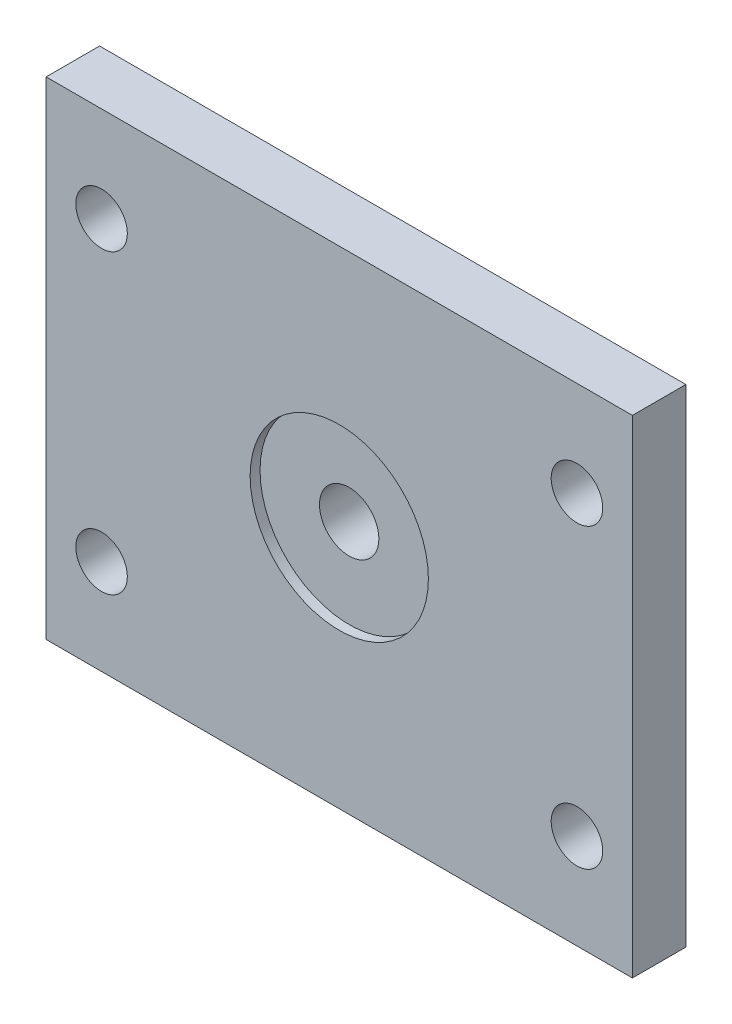
ISO-10303-21;
HEADER;
FILE_DESCRIPTION(('STEP AP214'),'2;1');
FILE_NAME('part.step','',(''),(''),'','','');
FILE_SCHEMA(('AUTOMOTIVE_DESIGN { 1 0 10303 214 1 1 1 1 }'));
ENDSEC;
DATA;
#1=APPLICATION_CONTEXT('core data for automotive mechanical design processes');
#2=APPLICATION_PROTOCOL_DEFINITION('international standard','automotive_design',2000,#1);
#3=PRODUCT_CONTEXT('',#1,'mechanical');
#4=PRODUCT('Part','Part','',(#3));
#5=PRODUCT_RELATED_PRODUCT_CATEGORY('part','',(#4));
#6=PRODUCT_DEFINITION_FORMATION('','',#4);
#7=PRODUCT_DEFINITION_CONTEXT('part definition',#1,'design');
#8=PRODUCT_DEFINITION('design','',#6,#7);
#9=PRODUCT_DEFINITION_SHAPE('','',#8);
#10=(LENGTH_UNIT() NAMED_UNIT(*) SI_UNIT(.MILLI.,.METRE.));
#11=(NAMED_UNIT(*) PLANE_ANGLE_UNIT() SI_UNIT($,.RADIAN.));
#12=(NAMED_UNIT(*) SI_UNIT($,.STERADIAN.) SOLID_ANGLE_UNIT());
#13=UNCERTAINTY_MEASURE_WITH_UNIT(LENGTH_MEASURE(1.E-05),#10,'distance_accuracy_value','');
#14=(GEOMETRIC_REPRESENTATION_CONTEXT(3) GLOBAL_UNCERTAINTY_ASSIGNED_CONTEXT((#13)) GLOBAL_UNIT_ASSIGNED_CONTEXT((#10,
#11,#12)) REPRESENTATION_CONTEXT('',''));
#15=CARTESIAN_POINT('',(0.,0.,0.));
#16=DIRECTION('',(0.,0.,1.));
#17=DIRECTION('',(1.,0.,0.));
#18=AXIS2_PLACEMENT_3D('',#15,#16,#17);
#19=CARTESIAN_POINT('',(-148.,123.,27.));
#20=DIRECTION('',(0.,0.,1.));
#21=DIRECTION('',(1.,0.,0.));
#22=AXIS2_PLACEMENT_3D('',#19,#20,#21);
#23=PLANE('',#22);
#24=CARTESIAN_POINT('',(-120.,-75.,27.));
#25=DIRECTION('',(0.,0.,1.));
#26=DIRECTION('',(1.,0.,0.));
#27=AXIS2_PLACEMENT_3D('',#24,#25,#26);
#28=CIRCLE('',#27,13.);
#29=CARTESIAN_POINT('',(-107.,-75.,27.));
#30=VERTEX_POINT('',#29);
#31=EDGE_CURVE('E129',#30,#30,#28,.T.);
#32=ORIENTED_EDGE('',*,*,#31,.F.);
#33=EDGE_LOOP('',(#32));
#34=FACE_BOUND('',#33,.T.);
#35=CARTESIAN_POINT('',(120.,75.,27.));
#36=DIRECTION('',(0.,0.,1.));
#37=DIRECTION('',(1.,0.,0.));
#38=AXIS2_PLACEMENT_3D('',#35,#36,#37);
#39=CIRCLE('',#38,13.);
#40=CARTESIAN_POINT('',(133.,75.,27.));
#41=VERTEX_POINT('',#40);
#42=EDGE_CURVE('E117',#41,#41,#39,.T.);
#43=ORIENTED_EDGE('',*,*,#42,.F.);
#44=EDGE_LOOP('',(#43));
#45=FACE_BOUND('',#44,.T.);
#46=DIRECTION('',(0.,-1.,0.));
#47=VECTOR('',#46,1.);
#48=CARTESIAN_POINT('',(-148.,-123.,27.));
#49=LINE('',#48,#47);
#50=CARTESIAN_POINT('',(-148.,123.,27.));
#51=VERTEX_POINT('',#50);
#52=CARTESIAN_POINT('',(-148.,-123.,27.));
#53=VERTEX_POINT('',#52);
#54=EDGE_CURVE('E87',#51,#53,#49,.T.);
#55=ORIENTED_EDGE('',*,*,#54,.T.);
#56=DIRECTION('',(1.,0.,0.));
#57=VECTOR('',#56,1.);
#58=CARTESIAN_POINT('',(148.,-123.,27.));
#59=LINE('',#58,#57);
#60=CARTESIAN_POINT('',(148.,-123.,27.));
#61=VERTEX_POINT('',#60);
#62=EDGE_CURVE('E82',#53,#61,#59,.T.);
#63=ORIENTED_EDGE('',*,*,#62,.T.);
#64=DIRECTION('',(0.,1.,0.));
#65=VECTOR('',#64,1.);
#66=CARTESIAN_POINT('',(148.,-123.,27.));
#67=LINE('',#66,#65);
#68=CARTESIAN_POINT('',(148.,123.,27.));
#69=VERTEX_POINT('',#68);
#70=EDGE_CURVE('E85',#61,#69,#67,.T.);
#71=ORIENTED_EDGE('',*,*,#70,.T.);
#72=DIRECTION('',(-1.,0.,0.));
#73=VECTOR('',#72,1.);
#74=CARTESIAN_POINT('',(148.,123.,27.));
#75=LINE('',#74,#73);
#76=EDGE_CURVE('E52',#69,#51,#75,.T.);
#77=ORIENTED_EDGE('',*,*,#76,.T.);
#78=EDGE_LOOP('',(#55,#63,#71,#77));
#79=FACE_BOUND('',#78,.T.);
#80=CARTESIAN_POINT('',(-120.,75.,27.));
#81=DIRECTION('',(0.,0.,1.));
#82=DIRECTION('',(1.,0.,0.));
#83=AXIS2_PLACEMENT_3D('',#80,#81,#82);
#84=CIRCLE('',#83,13.);
#85=CARTESIAN_POINT('',(-107.,75.,27.));
#86=VERTEX_POINT('',#85);
#87=EDGE_CURVE('E102',#86,#86,#84,.T.);
#88=ORIENTED_EDGE('',*,*,#87,.F.);
#89=EDGE_LOOP('',(#88));
#90=FACE_BOUND('',#89,.T.);
#91=CARTESIAN_POINT('',(120.,-75.,27.));
#92=DIRECTION('',(0.,0.,1.));
#93=DIRECTION('',(1.,0.,0.));
#94=AXIS2_PLACEMENT_3D('',#91,#92,#93);
#95=CIRCLE('',#94,13.);
#96=CARTESIAN_POINT('',(133.,-75.,27.));
#97=VERTEX_POINT('',#96);
#98=EDGE_CURVE('E123',#97,#97,#95,.T.);
#99=ORIENTED_EDGE('',*,*,#98,.F.);
#100=EDGE_LOOP('',(#99));
#101=FACE_BOUND('',#100,.T.);
#102=CARTESIAN_POINT('',(0.,0.,27.));
#103=DIRECTION('',(0.,0.,-1.));
#104=DIRECTION('',(-1.,0.,0.));
#105=AXIS2_PLACEMENT_3D('',#102,#103,#104);
#106=CIRCLE('',#105,45.);
#107=CARTESIAN_POINT('',(-45.,0.,27.));
#108=VERTEX_POINT('',#107);
#109=EDGE_CURVE('E138',#108,#108,#106,.T.);
#110=ORIENTED_EDGE('',*,*,#109,.T.);
#111=EDGE_LOOP('',(#110));
#112=FACE_BOUND('',#111,.T.);
#113=ADVANCED_FACE('F35',(#34,#45,#79,#90,#101,#112),#23,.T.);
#114=CARTESIAN_POINT('',(-148.,123.,0.));
#115=DIRECTION('',(0.,0.,1.));
#116=DIRECTION('',(1.,0.,0.));
#117=AXIS2_PLACEMENT_3D('',#114,#115,#116);
#118=PLANE('',#117);
#119=CARTESIAN_POINT('',(0.,0.,0.));
#120=DIRECTION('',(0.,0.,1.));
#121=DIRECTION('',(1.,0.,0.));
#122=AXIS2_PLACEMENT_3D('',#119,#120,#121);
#123=CIRCLE('',#122,15.);
#124=CARTESIAN_POINT('',(15.,0.,0.));
#125=VERTEX_POINT('',#124);
#126=EDGE_CURVE('E141',#125,#125,#123,.T.);
#127=ORIENTED_EDGE('',*,*,#126,.T.);
#128=EDGE_LOOP('',(#127));
#129=FACE_BOUND('',#128,.T.);
#130=CARTESIAN_POINT('',(120.,-75.,0.));
#131=DIRECTION('',(0.,0.,1.));
#132=DIRECTION('',(1.,0.,0.));
#133=AXIS2_PLACEMENT_3D('',#130,#131,#132);
#134=CIRCLE('',#133,13.);
#135=CARTESIAN_POINT('',(133.,-75.,0.));
#136=VERTEX_POINT('',#135);
#137=EDGE_CURVE('E126',#136,#136,#134,.T.);
#138=ORIENTED_EDGE('',*,*,#137,.T.);
#139=EDGE_LOOP('',(#138));
#140=FACE_BOUND('',#139,.T.);
#141=CARTESIAN_POINT('',(-120.,75.,0.));
#142=DIRECTION('',(0.,0.,1.));
#143=DIRECTION('',(1.,0.,0.));
#144=AXIS2_PLACEMENT_3D('',#141,#142,#143);
#145=CIRCLE('',#144,13.);
#146=CARTESIAN_POINT('',(-107.,75.,0.));
#147=VERTEX_POINT('',#146);
#148=EDGE_CURVE('E114',#147,#147,#145,.T.);
#149=ORIENTED_EDGE('',*,*,#148,.T.);
#150=EDGE_LOOP('',(#149));
#151=FACE_BOUND('',#150,.T.);
#152=DIRECTION('',(0.,-1.,0.));
#153=VECTOR('',#152,1.);
#154=CARTESIAN_POINT('',(-148.,-123.,0.));
#155=LINE('',#154,#153);
#156=CARTESIAN_POINT('',(-148.,123.,0.));
#157=VERTEX_POINT('',#156);
#158=CARTESIAN_POINT('',(-148.,-123.,0.));
#159=VERTEX_POINT('',#158);
#160=EDGE_CURVE('E99',#157,#159,#155,.T.);
#161=ORIENTED_EDGE('',*,*,#160,.F.);
#162=DIRECTION('',(-1.,0.,0.));
#163=VECTOR('',#162,1.);
#164=CARTESIAN_POINT('',(148.,123.,0.));
#165=LINE('',#164,#163);
#166=CARTESIAN_POINT('',(148.,123.,0.));
#167=VERTEX_POINT('',#166);
#168=EDGE_CURVE('E75',#167,#157,#165,.T.);
#169=ORIENTED_EDGE('',*,*,#168,.F.);
#170=DIRECTION('',(0.,1.,0.));
#171=VECTOR('',#170,1.);
#172=CARTESIAN_POINT('',(148.,-123.,0.));
#173=LINE('',#172,#171);
#174=CARTESIAN_POINT('',(148.,-123.,0.));
#175=VERTEX_POINT('',#174);
#176=EDGE_CURVE('E69',#175,#167,#173,.T.);
#177=ORIENTED_EDGE('',*,*,#176,.F.);
#178=DIRECTION('',(1.,0.,0.));
#179=VECTOR('',#178,1.);
#180=CARTESIAN_POINT('',(148.,-123.,0.));
#181=LINE('',#180,#179);
#182=EDGE_CURVE('E91',#159,#175,#181,.T.);
#183=ORIENTED_EDGE('',*,*,#182,.F.);
#184=EDGE_LOOP('',(#161,#169,#177,#183));
#185=FACE_BOUND('',#184,.T.);
#186=CARTESIAN_POINT('',(120.,75.,0.));
#187=DIRECTION('',(0.,0.,1.));
#188=DIRECTION('',(1.,0.,0.));
#189=AXIS2_PLACEMENT_3D('',#186,#187,#188);
#190=CIRCLE('',#189,13.);
#191=CARTESIAN_POINT('',(133.,75.,0.));
#192=VERTEX_POINT('',#191);
#193=EDGE_CURVE('E120',#192,#192,#190,.T.);
#194=ORIENTED_EDGE('',*,*,#193,.T.);
#195=EDGE_LOOP('',(#194));
#196=FACE_BOUND('',#195,.T.);
#197=CARTESIAN_POINT('',(-120.,-75.,0.));
#198=DIRECTION('',(0.,0.,1.));
#199=DIRECTION('',(1.,0.,0.));
#200=AXIS2_PLACEMENT_3D('',#197,#198,#199);
#201=CIRCLE('',#200,13.);
#202=CARTESIAN_POINT('',(-107.,-75.,0.));
#203=VERTEX_POINT('',#202);
#204=EDGE_CURVE('E132',#203,#203,#201,.T.);
#205=ORIENTED_EDGE('',*,*,#204,.T.);
#206=EDGE_LOOP('',(#205));
#207=FACE_BOUND('',#206,.T.);
#208=ADVANCED_FACE('F110',(#129,#140,#151,#185,#196,#207),#118,.F.);
#209=CARTESIAN_POINT('',(-148.,-123.,27.));
#210=DIRECTION('',(1.,0.,0.));
#211=DIRECTION('',(0.,0.,-1.));
#212=AXIS2_PLACEMENT_3D('',#209,#210,#211);
#213=PLANE('',#212);
#214=ORIENTED_EDGE('',*,*,#160,.T.);
#215=DIRECTION('',(0.,0.,-1.));
#216=VECTOR('',#215,1.);
#217=CARTESIAN_POINT('',(-148.,-123.,27.));
#218=LINE('',#217,#216);
#219=EDGE_CURVE('E11',#53,#159,#218,.T.);
#220=ORIENTED_EDGE('',*,*,#219,.F.);
#221=ORIENTED_EDGE('',*,*,#54,.F.);
#222=DIRECTION('',(0.,0.,-1.));
#223=VECTOR('',#222,1.);
#224=CARTESIAN_POINT('',(-148.,123.,27.));
#225=LINE('',#224,#223);
#226=EDGE_CURVE('E95',#51,#157,#225,.T.);
#227=ORIENTED_EDGE('',*,*,#226,.T.);
#228=EDGE_LOOP('',(#214,#220,#221,#227));
#229=FACE_BOUND('',#228,.T.);
#230=ADVANCED_FACE('F37',(#229),#213,.F.);
#231=CARTESIAN_POINT('',(148.,-123.,27.));
#232=DIRECTION('',(0.,1.,0.));
#233=DIRECTION('',(-1.,0.,0.));
#234=AXIS2_PLACEMENT_3D('',#231,#232,#233);
#235=PLANE('',#234);
#236=ORIENTED_EDGE('',*,*,#182,.T.);
#237=DIRECTION('',(0.,0.,-1.));
#238=VECTOR('',#237,1.);
#239=CARTESIAN_POINT('',(148.,-123.,27.));
#240=LINE('',#239,#238);
#241=EDGE_CURVE('E44',#61,#175,#240,.T.);
#242=ORIENTED_EDGE('',*,*,#241,.F.);
#243=ORIENTED_EDGE('',*,*,#62,.F.);
#244=ORIENTED_EDGE('',*,*,#219,.T.);
#245=EDGE_LOOP('',(#236,#242,#243,#244));
#246=FACE_BOUND('',#245,.T.);
#247=ADVANCED_FACE('F90',(#246),#235,.F.);
#248=CARTESIAN_POINT('',(148.,-123.,27.));
#249=DIRECTION('',(-1.,0.,0.));
#250=DIRECTION('',(0.,0.,1.));
#251=AXIS2_PLACEMENT_3D('',#248,#249,#250);
#252=PLANE('',#251);
#253=ORIENTED_EDGE('',*,*,#176,.T.);
#254=DIRECTION('',(0.,0.,-1.));
#255=VECTOR('',#254,1.);
#256=CARTESIAN_POINT('',(148.,123.,27.));
#257=LINE('',#256,#255);
#258=EDGE_CURVE('E92',#69,#167,#257,.T.);
#259=ORIENTED_EDGE('',*,*,#258,.F.);
#260=ORIENTED_EDGE('',*,*,#70,.F.);
#261=ORIENTED_EDGE('',*,*,#241,.T.);
#262=EDGE_LOOP('',(#253,#259,#260,#261));
#263=FACE_BOUND('',#262,.T.);
#264=ADVANCED_FACE('F93',(#263),#252,.F.);
#265=CARTESIAN_POINT('',(148.,123.,27.));
#266=DIRECTION('',(0.,-1.,0.));
#267=DIRECTION('',(0.,0.,-1.));
#268=AXIS2_PLACEMENT_3D('',#265,#266,#267);
#269=PLANE('',#268);
#270=ORIENTED_EDGE('',*,*,#168,.T.);
#271=ORIENTED_EDGE('',*,*,#226,.F.);
#272=ORIENTED_EDGE('',*,*,#76,.F.);
#273=ORIENTED_EDGE('',*,*,#258,.T.);
#274=EDGE_LOOP('',(#270,#271,#272,#273));
#275=FACE_BOUND('',#274,.T.);
#276=ADVANCED_FACE('F107',(#275),#269,.F.);
#277=CARTESIAN_POINT('',(-120.,75.,27.));
#278=DIRECTION('',(0.,0.,-1.));
#279=DIRECTION('',(-1.,0.,0.));
#280=AXIS2_PLACEMENT_3D('',#277,#278,#279);
#281=CYLINDRICAL_SURFACE('',#280,13.);
#282=ORIENTED_EDGE('',*,*,#87,.T.);
#283=EDGE_LOOP('',(#282));
#284=FACE_BOUND('',#283,.T.);
#285=ORIENTED_EDGE('',*,*,#148,.F.);
#286=EDGE_LOOP('',(#285));
#287=FACE_BOUND('',#286,.T.);
#288=ADVANCED_FACE('F183',(#284,#287),#281,.F.);
#289=CARTESIAN_POINT('',(120.,75.,27.));
#290=DIRECTION('',(0.,0.,-1.));
#291=DIRECTION('',(-1.,0.,0.));
#292=AXIS2_PLACEMENT_3D('',#289,#290,#291);
#293=CYLINDRICAL_SURFACE('',#292,13.);
#294=ORIENTED_EDGE('',*,*,#42,.T.);
#295=EDGE_LOOP('',(#294));
#296=FACE_BOUND('',#295,.T.);
#297=ORIENTED_EDGE('',*,*,#193,.F.);
#298=EDGE_LOOP('',(#297));
#299=FACE_BOUND('',#298,.T.);
#300=ADVANCED_FACE('F237',(#296,#299),#293,.F.);
#301=CARTESIAN_POINT('',(120.,-75.,27.));
#302=DIRECTION('',(0.,0.,-1.));
#303=DIRECTION('',(-1.,0.,0.));
#304=AXIS2_PLACEMENT_3D('',#301,#302,#303);
#305=CYLINDRICAL_SURFACE('',#304,13.);
#306=ORIENTED_EDGE('',*,*,#98,.T.);
#307=EDGE_LOOP('',(#306));
#308=FACE_BOUND('',#307,.T.);
#309=ORIENTED_EDGE('',*,*,#137,.F.);
#310=EDGE_LOOP('',(#309));
#311=FACE_BOUND('',#310,.T.);
#312=ADVANCED_FACE('F228',(#308,#311),#305,.F.);
#313=CARTESIAN_POINT('',(-120.,-75.,27.));
#314=DIRECTION('',(0.,0.,-1.));
#315=DIRECTION('',(-1.,0.,0.));
#316=AXIS2_PLACEMENT_3D('',#313,#314,#315);
#317=CYLINDRICAL_SURFACE('',#316,13.);
#318=ORIENTED_EDGE('',*,*,#31,.T.);
#319=EDGE_LOOP('',(#318));
#320=FACE_BOUND('',#319,.T.);
#321=ORIENTED_EDGE('',*,*,#204,.F.);
#322=EDGE_LOOP('',(#321));
#323=FACE_BOUND('',#322,.T.);
#324=ADVANCED_FACE('F167',(#320,#323),#317,.F.);
#325=CARTESIAN_POINT('',(0.,0.,22.));
#326=DIRECTION('',(0.,0.,1.));
#327=DIRECTION('',(1.,0.,0.));
#328=AXIS2_PLACEMENT_3D('',#325,#326,#327);
#329=CYLINDRICAL_SURFACE('',#328,45.);
#330=CARTESIAN_POINT('',(0.,0.,22.));
#331=DIRECTION('',(0.,0.,-1.));
#332=DIRECTION('',(-1.,0.,0.));
#333=AXIS2_PLACEMENT_3D('',#330,#331,#332);
#334=CIRCLE('',#333,45.);
#335=CARTESIAN_POINT('',(-45.,0.,22.));
#336=VERTEX_POINT('',#335);
#337=EDGE_CURVE('E135',#336,#336,#334,.T.);
#338=ORIENTED_EDGE('',*,*,#337,.T.);
#339=EDGE_LOOP('',(#338));
#340=FACE_BOUND('',#339,.T.);
#341=ORIENTED_EDGE('',*,*,#109,.F.);
#342=EDGE_LOOP('',(#341));
#343=FACE_BOUND('',#342,.T.);
#344=ADVANCED_FACE('F161',(#340,#343),#329,.F.);
#345=CARTESIAN_POINT('',(0.,0.,22.));
#346=DIRECTION('',(0.,0.,-1.));
#347=DIRECTION('',(-1.,0.,0.));
#348=AXIS2_PLACEMENT_3D('',#345,#346,#347);
#349=PLANE('',#348);
#350=CARTESIAN_POINT('',(0.,0.,22.));
#351=DIRECTION('',(0.,0.,1.));
#352=DIRECTION('',(1.,0.,0.));
#353=AXIS2_PLACEMENT_3D('',#350,#351,#352);
#354=CIRCLE('',#353,15.);
#355=CARTESIAN_POINT('',(15.,0.,22.));
#356=VERTEX_POINT('',#355);
#357=EDGE_CURVE('E144',#356,#356,#354,.T.);
#358=ORIENTED_EDGE('',*,*,#357,.F.);
#359=EDGE_LOOP('',(#358));
#360=FACE_BOUND('',#359,.T.);
#361=ORIENTED_EDGE('',*,*,#337,.F.);
#362=EDGE_LOOP('',(#361));
#363=FACE_BOUND('',#362,.T.);
#364=ADVANCED_FACE('F155',(#360,#363),#349,.F.);
#365=CARTESIAN_POINT('',(0.,0.,0.));
#366=DIRECTION('',(0.,0.,1.));
#367=DIRECTION('',(1.,0.,0.));
#368=AXIS2_PLACEMENT_3D('',#365,#366,#367);
#369=CYLINDRICAL_SURFACE('',#368,15.);
#370=ORIENTED_EDGE('',*,*,#126,.F.);
#371=EDGE_LOOP('',(#370));
#372=FACE_BOUND('',#371,.T.);
#373=ORIENTED_EDGE('',*,*,#357,.T.);
#374=EDGE_LOOP('',(#373));
#375=FACE_BOUND('',#374,.T.);
#376=ADVANCED_FACE('F152',(#372,#375),#369,.F.);
#377=CLOSED_SHELL('',(#113,#208,#230,#247,#264,#276,#288,#300,#312,#324,#344,#364,#376));
#378=MANIFOLD_SOLID_BREP('B2',#377);
#379=ADVANCED_BREP_SHAPE_REPRESENTATION('',(#18,#378),#14);
#380=SHAPE_DEFINITION_REPRESENTATION(#9,#379);
ENDSEC;
END-ISO-10303-21;
